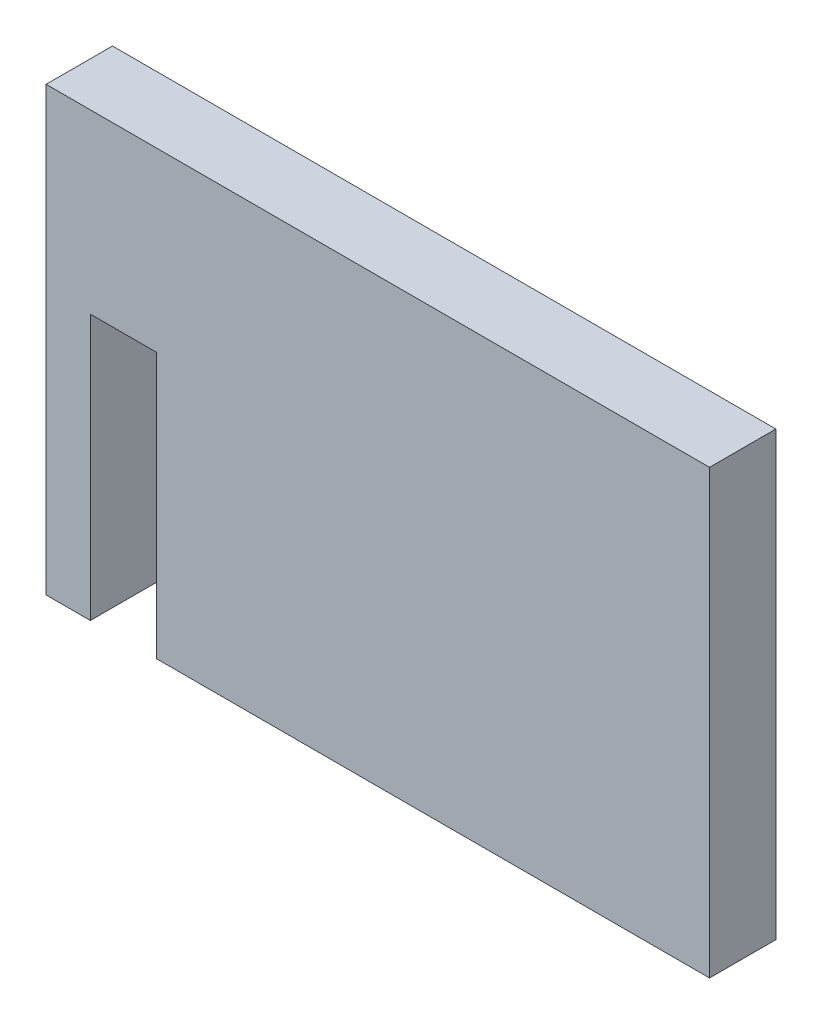
ISO-10303-21;
HEADER;
FILE_DESCRIPTION(('STEP AP214'),'2;1');
FILE_NAME('part.step','',(''),(''),'','','');
FILE_SCHEMA(('AUTOMOTIVE_DESIGN { 1 0 10303 214 1 1 1 1 }'));
ENDSEC;
DATA;
#1=APPLICATION_CONTEXT('core data for automotive mechanical design processes');
#2=APPLICATION_PROTOCOL_DEFINITION('international standard','automotive_design',2000,#1);
#3=PRODUCT_CONTEXT('',#1,'mechanical');
#4=PRODUCT('Part','Part','',(#3));
#5=PRODUCT_RELATED_PRODUCT_CATEGORY('part','',(#4));
#6=PRODUCT_DEFINITION_FORMATION('','',#4);
#7=PRODUCT_DEFINITION_CONTEXT('part definition',#1,'design');
#8=PRODUCT_DEFINITION('design','',#6,#7);
#9=PRODUCT_DEFINITION_SHAPE('','',#8);
#10=(LENGTH_UNIT() NAMED_UNIT(*) SI_UNIT(.MILLI.,.METRE.));
#11=(NAMED_UNIT(*) PLANE_ANGLE_UNIT() SI_UNIT($,.RADIAN.));
#12=(NAMED_UNIT(*) SI_UNIT($,.STERADIAN.) SOLID_ANGLE_UNIT());
#13=UNCERTAINTY_MEASURE_WITH_UNIT(LENGTH_MEASURE(1.E-05),#10,'distance_accuracy_value','');
#14=(GEOMETRIC_REPRESENTATION_CONTEXT(3) GLOBAL_UNCERTAINTY_ASSIGNED_CONTEXT((#13)) GLOBAL_UNIT_ASSIGNED_CONTEXT((#10,
#11,#12)) REPRESENTATION_CONTEXT('',''));
#15=CARTESIAN_POINT('',(0.,0.,0.));
#16=DIRECTION('',(0.,0.,1.));
#17=DIRECTION('',(1.,0.,0.));
#18=AXIS2_PLACEMENT_3D('',#15,#16,#17);
#19=CARTESIAN_POINT('',(13.0576776238448,10.,3.));
#20=DIRECTION('',(-1.,0.,0.));
#21=DIRECTION('',(0.,-1.,0.));
#22=AXIS2_PLACEMENT_3D('',#19,#20,#21);
#23=PLANE('',#22);
#24=DIRECTION('',(0.,1.,0.));
#25=VECTOR('',#24,1.);
#26=CARTESIAN_POINT('',(13.0576776238448,10.,0.));
#27=LINE('',#26,#25);
#28=CARTESIAN_POINT('',(13.0576776238448,-10.,0.));
#29=VERTEX_POINT('',#28);
#30=CARTESIAN_POINT('',(13.0576776238448,10.,0.));
#31=VERTEX_POINT('',#30);
#32=EDGE_CURVE('E129',#29,#31,#27,.T.);
#33=ORIENTED_EDGE('',*,*,#32,.T.);
#34=DIRECTION('',(0.,0.,-1.));
#35=VECTOR('',#34,1.);
#36=CARTESIAN_POINT('',(13.0576776238448,10.,3.));
#37=LINE('',#36,#35);
#38=CARTESIAN_POINT('',(13.0576776238448,10.,3.));
#39=VERTEX_POINT('',#38);
#40=EDGE_CURVE('E11',#39,#31,#37,.T.);
#41=ORIENTED_EDGE('',*,*,#40,.F.);
#42=DIRECTION('',(0.,1.,0.));
#43=VECTOR('',#42,1.);
#44=CARTESIAN_POINT('',(13.0576776238448,10.,3.));
#45=LINE('',#44,#43);
#46=CARTESIAN_POINT('',(13.0576776238448,-10.,3.));
#47=VERTEX_POINT('',#46);
#48=EDGE_CURVE('E143',#47,#39,#45,.T.);
#49=ORIENTED_EDGE('',*,*,#48,.F.);
#50=DIRECTION('',(0.,0.,-1.));
#51=VECTOR('',#50,1.);
#52=CARTESIAN_POINT('',(13.0576776238448,-10.,3.));
#53=LINE('',#52,#51);
#54=EDGE_CURVE('E125',#47,#29,#53,.T.);
#55=ORIENTED_EDGE('',*,*,#54,.T.);
#56=EDGE_LOOP('',(#33,#41,#49,#55));
#57=FACE_BOUND('',#56,.T.);
#58=ADVANCED_FACE('F33',(#57),#23,.F.);
#59=CARTESIAN_POINT('',(-16.9423223761552,10.,3.));
#60=DIRECTION('',(0.,-1.,0.));
#61=DIRECTION('',(0.,0.,-1.));
#62=AXIS2_PLACEMENT_3D('',#59,#60,#61);
#63=PLANE('',#62);
#64=DIRECTION('',(-1.,0.,0.));
#65=VECTOR('',#64,1.);
#66=CARTESIAN_POINT('',(-16.9423223761552,10.,0.));
#67=LINE('',#66,#65);
#68=CARTESIAN_POINT('',(-16.9423223761552,10.,0.));
#69=VERTEX_POINT('',#68);
#70=EDGE_CURVE('E132',#31,#69,#67,.T.);
#71=ORIENTED_EDGE('',*,*,#70,.T.);
#72=DIRECTION('',(0.,0.,-1.));
#73=VECTOR('',#72,1.);
#74=CARTESIAN_POINT('',(-16.9423223761552,10.,3.));
#75=LINE('',#74,#73);
#76=CARTESIAN_POINT('',(-16.9423223761552,10.,3.));
#77=VERTEX_POINT('',#76);
#78=EDGE_CURVE('E41',#77,#69,#75,.T.);
#79=ORIENTED_EDGE('',*,*,#78,.F.);
#80=DIRECTION('',(-1.,0.,0.));
#81=VECTOR('',#80,1.);
#82=CARTESIAN_POINT('',(-16.9423223761552,10.,3.));
#83=LINE('',#82,#81);
#84=EDGE_CURVE('E92',#39,#77,#83,.T.);
#85=ORIENTED_EDGE('',*,*,#84,.F.);
#86=ORIENTED_EDGE('',*,*,#40,.T.);
#87=EDGE_LOOP('',(#71,#79,#85,#86));
#88=FACE_BOUND('',#87,.T.);
#89=ADVANCED_FACE('F178',(#88),#63,.F.);
#90=CARTESIAN_POINT('',(-16.9423223761552,10.,3.));
#91=DIRECTION('',(1.,0.,0.));
#92=DIRECTION('',(0.,1.,0.));
#93=AXIS2_PLACEMENT_3D('',#90,#91,#92);
#94=PLANE('',#93);
#95=DIRECTION('',(0.,-1.,0.));
#96=VECTOR('',#95,1.);
#97=CARTESIAN_POINT('',(-16.9423223761552,10.,0.));
#98=LINE('',#97,#96);
#99=CARTESIAN_POINT('',(-16.9423223761552,-10.,0.));
#100=VERTEX_POINT('',#99);
#101=EDGE_CURVE('E134',#69,#100,#98,.T.);
#102=ORIENTED_EDGE('',*,*,#101,.T.);
#103=DIRECTION('',(0.,0.,-1.));
#104=VECTOR('',#103,1.);
#105=CARTESIAN_POINT('',(-16.9423223761552,-10.,3.));
#106=LINE('',#105,#104);
#107=CARTESIAN_POINT('',(-16.9423223761552,-10.,3.));
#108=VERTEX_POINT('',#107);
#109=EDGE_CURVE('E150',#108,#100,#106,.T.);
#110=ORIENTED_EDGE('',*,*,#109,.F.);
#111=DIRECTION('',(0.,-1.,0.));
#112=VECTOR('',#111,1.);
#113=CARTESIAN_POINT('',(-16.9423223761552,10.,3.));
#114=LINE('',#113,#112);
#115=EDGE_CURVE('E158',#77,#108,#114,.T.);
#116=ORIENTED_EDGE('',*,*,#115,.F.);
#117=ORIENTED_EDGE('',*,*,#78,.T.);
#118=EDGE_LOOP('',(#102,#110,#116,#117));
#119=FACE_BOUND('',#118,.T.);
#120=ADVANCED_FACE('F156',(#119),#94,.F.);
#121=CARTESIAN_POINT('',(-16.9423223761552,-10.,3.));
#122=DIRECTION('',(0.,1.,0.));
#123=DIRECTION('',(0.,0.,1.));
#124=AXIS2_PLACEMENT_3D('',#121,#122,#123);
#125=PLANE('',#124);
#126=DIRECTION('',(1.,0.,0.));
#127=VECTOR('',#126,1.);
#128=CARTESIAN_POINT('',(-16.9423223761552,-10.,0.));
#129=LINE('',#128,#127);
#130=CARTESIAN_POINT('',(-14.9423223761552,-10.,0.));
#131=VERTEX_POINT('',#130);
#132=EDGE_CURVE('E136',#100,#131,#129,.T.);
#133=ORIENTED_EDGE('',*,*,#132,.T.);
#134=DIRECTION('',(0.,0.,-1.));
#135=VECTOR('',#134,1.);
#136=CARTESIAN_POINT('',(-14.9423223761552,-10.,3.));
#137=LINE('',#136,#135);
#138=CARTESIAN_POINT('',(-14.9423223761552,-10.,3.));
#139=VERTEX_POINT('',#138);
#140=EDGE_CURVE('E147',#139,#131,#137,.T.);
#141=ORIENTED_EDGE('',*,*,#140,.F.);
#142=DIRECTION('',(1.,0.,0.));
#143=VECTOR('',#142,1.);
#144=CARTESIAN_POINT('',(-16.9423223761552,-10.,3.));
#145=LINE('',#144,#143);
#146=EDGE_CURVE('E170',#108,#139,#145,.T.);
#147=ORIENTED_EDGE('',*,*,#146,.F.);
#148=ORIENTED_EDGE('',*,*,#109,.T.);
#149=EDGE_LOOP('',(#133,#141,#147,#148));
#150=FACE_BOUND('',#149,.T.);
#151=ADVANCED_FACE('F166',(#150),#125,.F.);
#152=CARTESIAN_POINT('',(-14.9423223761552,2.,3.));
#153=DIRECTION('',(-1.,0.,0.));
#154=DIRECTION('',(0.,0.,1.));
#155=AXIS2_PLACEMENT_3D('',#152,#153,#154);
#156=PLANE('',#155);
#157=DIRECTION('',(0.,1.,0.));
#158=VECTOR('',#157,1.);
#159=CARTESIAN_POINT('',(-14.9423223761552,2.,0.));
#160=LINE('',#159,#158);
#161=CARTESIAN_POINT('',(-14.9423223761552,2.,0.));
#162=VERTEX_POINT('',#161);
#163=EDGE_CURVE('E138',#131,#162,#160,.T.);
#164=ORIENTED_EDGE('',*,*,#163,.T.);
#165=DIRECTION('',(0.,0.,-1.));
#166=VECTOR('',#165,1.);
#167=CARTESIAN_POINT('',(-14.9423223761552,2.,3.));
#168=LINE('',#167,#166);
#169=CARTESIAN_POINT('',(-14.9423223761552,2.,3.));
#170=VERTEX_POINT('',#169);
#171=EDGE_CURVE('E120',#170,#162,#168,.T.);
#172=ORIENTED_EDGE('',*,*,#171,.F.);
#173=DIRECTION('',(0.,1.,0.));
#174=VECTOR('',#173,1.);
#175=CARTESIAN_POINT('',(-14.9423223761552,2.,3.));
#176=LINE('',#175,#174);
#177=EDGE_CURVE('E111',#139,#170,#176,.T.);
#178=ORIENTED_EDGE('',*,*,#177,.F.);
#179=ORIENTED_EDGE('',*,*,#140,.T.);
#180=EDGE_LOOP('',(#164,#172,#178,#179));
#181=FACE_BOUND('',#180,.T.);
#182=ADVANCED_FACE('F169',(#181),#156,.F.);
#183=CARTESIAN_POINT('',(-14.9423223761552,2.,3.));
#184=DIRECTION('',(0.,1.,0.));
#185=DIRECTION('',(-1.,0.,0.));
#186=AXIS2_PLACEMENT_3D('',#183,#184,#185);
#187=PLANE('',#186);
#188=DIRECTION('',(1.,0.,0.));
#189=VECTOR('',#188,1.);
#190=CARTESIAN_POINT('',(-14.9423223761552,2.,0.));
#191=LINE('',#190,#189);
#192=CARTESIAN_POINT('',(-11.9423223761552,2.,0.));
#193=VERTEX_POINT('',#192);
#194=EDGE_CURVE('E119',#162,#193,#191,.T.);
#195=ORIENTED_EDGE('',*,*,#194,.T.);
#196=DIRECTION('',(0.,0.,-1.));
#197=VECTOR('',#196,1.);
#198=CARTESIAN_POINT('',(-11.9423223761552,2.,3.));
#199=LINE('',#198,#197);
#200=CARTESIAN_POINT('',(-11.9423223761552,2.,3.));
#201=VERTEX_POINT('',#200);
#202=EDGE_CURVE('E116',#201,#193,#199,.T.);
#203=ORIENTED_EDGE('',*,*,#202,.F.);
#204=DIRECTION('',(1.,0.,0.));
#205=VECTOR('',#204,1.);
#206=CARTESIAN_POINT('',(-14.9423223761552,2.,3.));
#207=LINE('',#206,#205);
#208=EDGE_CURVE('E105',#170,#201,#207,.T.);
#209=ORIENTED_EDGE('',*,*,#208,.F.);
#210=ORIENTED_EDGE('',*,*,#171,.T.);
#211=EDGE_LOOP('',(#195,#203,#209,#210));
#212=FACE_BOUND('',#211,.T.);
#213=ADVANCED_FACE('F117',(#212),#187,.F.);
#214=CARTESIAN_POINT('',(-11.9423223761552,2.,3.));
#215=DIRECTION('',(1.,0.,0.));
#216=DIRECTION('',(0.,1.,0.));
#217=AXIS2_PLACEMENT_3D('',#214,#215,#216);
#218=PLANE('',#217);
#219=DIRECTION('',(0.,-1.,0.));
#220=VECTOR('',#219,1.);
#221=CARTESIAN_POINT('',(-11.9423223761552,2.,0.));
#222=LINE('',#221,#220);
#223=CARTESIAN_POINT('',(-11.9423223761552,-10.,0.));
#224=VERTEX_POINT('',#223);
#225=EDGE_CURVE('E78',#193,#224,#222,.T.);
#226=ORIENTED_EDGE('',*,*,#225,.T.);
#227=DIRECTION('',(0.,0.,-1.));
#228=VECTOR('',#227,1.);
#229=CARTESIAN_POINT('',(-11.9423223761552,-10.,3.));
#230=LINE('',#229,#228);
#231=CARTESIAN_POINT('',(-11.9423223761552,-10.,3.));
#232=VERTEX_POINT('',#231);
#233=EDGE_CURVE('E121',#232,#224,#230,.T.);
#234=ORIENTED_EDGE('',*,*,#233,.F.);
#235=DIRECTION('',(0.,-1.,0.));
#236=VECTOR('',#235,1.);
#237=CARTESIAN_POINT('',(-11.9423223761552,2.,3.));
#238=LINE('',#237,#236);
#239=EDGE_CURVE('E109',#201,#232,#238,.T.);
#240=ORIENTED_EDGE('',*,*,#239,.F.);
#241=ORIENTED_EDGE('',*,*,#202,.T.);
#242=EDGE_LOOP('',(#226,#234,#240,#241));
#243=FACE_BOUND('',#242,.T.);
#244=ADVANCED_FACE('F123',(#243),#218,.F.);
#245=CARTESIAN_POINT('',(-11.9423223761552,-10.,3.));
#246=DIRECTION('',(0.,1.,0.));
#247=DIRECTION('',(0.,0.,1.));
#248=AXIS2_PLACEMENT_3D('',#245,#246,#247);
#249=PLANE('',#248);
#250=DIRECTION('',(1.,0.,0.));
#251=VECTOR('',#250,1.);
#252=CARTESIAN_POINT('',(-11.9423223761552,-10.,0.));
#253=LINE('',#252,#251);
#254=EDGE_CURVE('E84',#224,#29,#253,.T.);
#255=ORIENTED_EDGE('',*,*,#254,.T.);
#256=ORIENTED_EDGE('',*,*,#54,.F.);
#257=DIRECTION('',(1.,0.,0.));
#258=VECTOR('',#257,1.);
#259=CARTESIAN_POINT('',(-11.9423223761552,-10.,3.));
#260=LINE('',#259,#258);
#261=EDGE_CURVE('E49',#232,#47,#260,.T.);
#262=ORIENTED_EDGE('',*,*,#261,.F.);
#263=ORIENTED_EDGE('',*,*,#233,.T.);
#264=EDGE_LOOP('',(#255,#256,#262,#263));
#265=FACE_BOUND('',#264,.T.);
#266=ADVANCED_FACE('F194',(#265),#249,.F.);
#267=CARTESIAN_POINT('',(0.,0.,3.));
#268=DIRECTION('',(0.,0.,1.));
#269=DIRECTION('',(1.,0.,0.));
#270=AXIS2_PLACEMENT_3D('',#267,#268,#269);
#271=PLANE('',#270);
#272=ORIENTED_EDGE('',*,*,#48,.T.);
#273=ORIENTED_EDGE('',*,*,#84,.T.);
#274=ORIENTED_EDGE('',*,*,#115,.T.);
#275=ORIENTED_EDGE('',*,*,#146,.T.);
#276=ORIENTED_EDGE('',*,*,#177,.T.);
#277=ORIENTED_EDGE('',*,*,#208,.T.);
#278=ORIENTED_EDGE('',*,*,#239,.T.);
#279=ORIENTED_EDGE('',*,*,#261,.T.);
#280=EDGE_LOOP('',(#272,#273,#274,#275,#276,#277,#278,#279));
#281=FACE_BOUND('',#280,.T.);
#282=ADVANCED_FACE('F107',(#281),#271,.T.);
#283=CARTESIAN_POINT('',(0.,0.,0.));
#284=DIRECTION('',(0.,0.,1.));
#285=DIRECTION('',(1.,0.,0.));
#286=AXIS2_PLACEMENT_3D('',#283,#284,#285);
#287=PLANE('',#286);
#288=ORIENTED_EDGE('',*,*,#32,.F.);
#289=ORIENTED_EDGE('',*,*,#254,.F.);
#290=ORIENTED_EDGE('',*,*,#225,.F.);
#291=ORIENTED_EDGE('',*,*,#194,.F.);
#292=ORIENTED_EDGE('',*,*,#163,.F.);
#293=ORIENTED_EDGE('',*,*,#132,.F.);
#294=ORIENTED_EDGE('',*,*,#101,.F.);
#295=ORIENTED_EDGE('',*,*,#70,.F.);
#296=EDGE_LOOP('',(#288,#289,#290,#291,#292,#293,#294,#295));
#297=FACE_BOUND('',#296,.T.);
#298=ADVANCED_FACE('F162',(#297),#287,.F.);
#299=CLOSED_SHELL('',(#58,#89,#120,#151,#182,#213,#244,#266,#282,#298));
#300=MANIFOLD_SOLID_BREP('B2',#299);
#301=ADVANCED_BREP_SHAPE_REPRESENTATION('',(#18,#300),#14);
#302=SHAPE_DEFINITION_REPRESENTATION(#9,#301);
ENDSEC;
END-ISO-10303-21;
